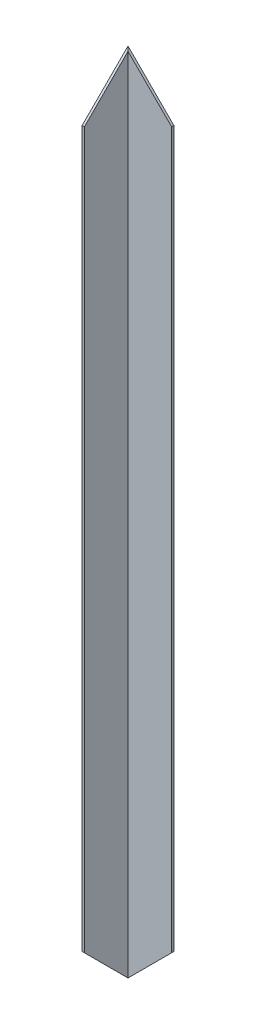
ISO-10303-21;
HEADER;
FILE_DESCRIPTION(('STEP AP214'),'2;1');
FILE_NAME('part.step','',(''),(''),'','','');
FILE_SCHEMA(('AUTOMOTIVE_DESIGN { 1 0 10303 214 1 1 1 1 }'));
ENDSEC;
DATA;
#1=APPLICATION_CONTEXT('core data for automotive mechanical design processes');
#2=APPLICATION_PROTOCOL_DEFINITION('international standard','automotive_design',2000,#1);
#3=PRODUCT_CONTEXT('',#1,'mechanical');
#4=PRODUCT('Part','Part','',(#3));
#5=PRODUCT_RELATED_PRODUCT_CATEGORY('part','',(#4));
#6=PRODUCT_DEFINITION_FORMATION('','',#4);
#7=PRODUCT_DEFINITION_CONTEXT('part definition',#1,'design');
#8=PRODUCT_DEFINITION('design','',#6,#7);
#9=PRODUCT_DEFINITION_SHAPE('','',#8);
#10=(LENGTH_UNIT() NAMED_UNIT(*) SI_UNIT(.MILLI.,.METRE.));
#11=(NAMED_UNIT(*) PLANE_ANGLE_UNIT() SI_UNIT($,.RADIAN.));
#12=(NAMED_UNIT(*) SI_UNIT($,.STERADIAN.) SOLID_ANGLE_UNIT());
#13=UNCERTAINTY_MEASURE_WITH_UNIT(LENGTH_MEASURE(1.E-05),#10,'distance_accuracy_value','');
#14=(GEOMETRIC_REPRESENTATION_CONTEXT(3) GLOBAL_UNCERTAINTY_ASSIGNED_CONTEXT((#13)) GLOBAL_UNIT_ASSIGNED_CONTEXT((#10,
#11,#12)) REPRESENTATION_CONTEXT('',''));
#15=CARTESIAN_POINT('',(0.,0.,0.));
#16=DIRECTION('',(0.,0.,1.));
#17=DIRECTION('',(1.,0.,0.));
#18=AXIS2_PLACEMENT_3D('',#15,#16,#17);
#19=CARTESIAN_POINT('',(-20.,704.,-20.1136363636364));
#20=DIRECTION('',(1.,0.,0.));
#21=DIRECTION('',(0.,0.,-1.));
#22=AXIS2_PLACEMENT_3D('',#19,#20,#21);
#23=PLANE('',#22);
#24=DIRECTION('',(0.,-1.,0.));
#25=VECTOR('',#24,1.);
#26=CARTESIAN_POINT('',(-20.,704.,19.8863636363636));
#27=LINE('',#26,#25);
#28=CARTESIAN_POINT('',(-20.,664.,19.8863636363636));
#29=VERTEX_POINT('',#28);
#30=CARTESIAN_POINT('',(-20.,39.9999999999996,19.8863636363636));
#31=VERTEX_POINT('',#30);
#32=EDGE_CURVE('E109',#29,#31,#27,.T.);
#33=ORIENTED_EDGE('',*,*,#32,.F.);
#34=DIRECTION('',(0.,-0.707106781186544,0.707106781186551));
#35=VECTOR('',#34,1.);
#36=CARTESIAN_POINT('',(-20.,704.,-20.1136363636364));
#37=LINE('',#36,#35);
#38=CARTESIAN_POINT('',(-20.,704.,-20.1136363636364));
#39=VERTEX_POINT('',#38);
#40=EDGE_CURVE('E127',#39,#29,#37,.T.);
#41=ORIENTED_EDGE('',*,*,#40,.F.);
#42=DIRECTION('',(0.,-1.,0.));
#43=VECTOR('',#42,1.);
#44=CARTESIAN_POINT('',(-20.,704.,-20.1136363636364));
#45=LINE('',#44,#43);
#46=CARTESIAN_POINT('',(-20.,0.,-20.1136363636364));
#47=VERTEX_POINT('',#46);
#48=EDGE_CURVE('E95',#39,#47,#45,.T.);
#49=ORIENTED_EDGE('',*,*,#48,.T.);
#50=DIRECTION('',(0.,-0.707106781186544,-0.707106781186551));
#51=VECTOR('',#50,1.);
#52=CARTESIAN_POINT('',(-20.,0.,-20.1136363636364));
#53=LINE('',#52,#51);
#54=EDGE_CURVE('E126',#31,#47,#53,.T.);
#55=ORIENTED_EDGE('',*,*,#54,.F.);
#56=EDGE_LOOP('',(#33,#41,#49,#55));
#57=FACE_BOUND('',#56,.T.);
#58=ADVANCED_FACE('F32',(#57),#23,.F.);
#59=CARTESIAN_POINT('',(-20.,704.,19.8863636363636));
#60=DIRECTION('',(0.,0.,-1.));
#61=DIRECTION('',(-1.,0.,0.));
#62=AXIS2_PLACEMENT_3D('',#59,#60,#61);
#63=PLANE('',#62);
#64=DIRECTION('',(0.,-1.,0.));
#65=VECTOR('',#64,1.);
#66=CARTESIAN_POINT('',(-18.,704.,19.8863636363636));
#67=LINE('',#66,#65);
#68=CARTESIAN_POINT('',(-18.,664.,19.8863636363636));
#69=VERTEX_POINT('',#68);
#70=CARTESIAN_POINT('',(-18.,39.9999999999996,19.8863636363636));
#71=VERTEX_POINT('',#70);
#72=EDGE_CURVE('E107',#69,#71,#67,.T.);
#73=ORIENTED_EDGE('',*,*,#72,.F.);
#74=DIRECTION('',(-1.,0.,0.));
#75=VECTOR('',#74,1.);
#76=CARTESIAN_POINT('',(20.,664.,19.8863636363636));
#77=LINE('',#76,#75);
#78=EDGE_CURVE('E130',#69,#29,#77,.T.);
#79=ORIENTED_EDGE('',*,*,#78,.T.);
#80=ORIENTED_EDGE('',*,*,#32,.T.);
#81=DIRECTION('',(-1.,0.,0.));
#82=VECTOR('',#81,1.);
#83=CARTESIAN_POINT('',(570.,39.9999999999996,19.8863636363635));
#84=LINE('',#83,#82);
#85=EDGE_CURVE('E139',#71,#31,#84,.T.);
#86=ORIENTED_EDGE('',*,*,#85,.F.);
#87=EDGE_LOOP('',(#73,#79,#80,#86));
#88=FACE_BOUND('',#87,.T.);
#89=ADVANCED_FACE('F153',(#88),#63,.F.);
#90=CARTESIAN_POINT('',(-18.,704.,-18.1136363636364));
#91=DIRECTION('',(-1.,0.,0.));
#92=DIRECTION('',(0.,0.,1.));
#93=AXIS2_PLACEMENT_3D('',#90,#91,#92);
#94=PLANE('',#93);
#95=DIRECTION('',(0.,-1.,0.));
#96=VECTOR('',#95,1.);
#97=CARTESIAN_POINT('',(-18.,704.,-18.1136363636364));
#98=LINE('',#97,#96);
#99=CARTESIAN_POINT('',(-18.,702.,-18.1136363636364));
#100=VERTEX_POINT('',#99);
#101=CARTESIAN_POINT('',(-18.,2.,-18.1136363636364));
#102=VERTEX_POINT('',#101);
#103=EDGE_CURVE('E100',#100,#102,#98,.T.);
#104=ORIENTED_EDGE('',*,*,#103,.F.);
#105=DIRECTION('',(0.,-0.707106781186544,0.707106781186551));
#106=VECTOR('',#105,1.);
#107=CARTESIAN_POINT('',(-18.,703.,-19.1136363636363));
#108=LINE('',#107,#106);
#109=EDGE_CURVE('E132',#100,#69,#108,.T.);
#110=ORIENTED_EDGE('',*,*,#109,.T.);
#111=ORIENTED_EDGE('',*,*,#72,.T.);
#112=DIRECTION('',(0.,-0.707106781186544,-0.707106781186551));
#113=VECTOR('',#112,1.);
#114=CARTESIAN_POINT('',(-18.,352.999999999996,332.886363636364));
#115=LINE('',#114,#113);
#116=EDGE_CURVE('E120',#71,#102,#115,.T.);
#117=ORIENTED_EDGE('',*,*,#116,.T.);
#118=EDGE_LOOP('',(#104,#110,#111,#117));
#119=FACE_BOUND('',#118,.T.);
#120=ADVANCED_FACE('F148',(#119),#94,.F.);
#121=CARTESIAN_POINT('',(-18.,704.,-18.1136363636364));
#122=DIRECTION('',(0.,0.,-1.));
#123=DIRECTION('',(-1.,0.,0.));
#124=AXIS2_PLACEMENT_3D('',#121,#122,#123);
#125=PLANE('',#124);
#126=DIRECTION('',(0.,-1.,0.));
#127=VECTOR('',#126,1.);
#128=CARTESIAN_POINT('',(20.,704.,-18.1136363636364));
#129=LINE('',#128,#127);
#130=CARTESIAN_POINT('',(20.,664.,-18.1136363636364));
#131=VERTEX_POINT('',#130);
#132=CARTESIAN_POINT('',(20.,40.0000000000001,-18.1136363636364));
#133=VERTEX_POINT('',#132);
#134=EDGE_CURVE('E46',#131,#133,#129,.T.);
#135=ORIENTED_EDGE('',*,*,#134,.F.);
#136=DIRECTION('',(-0.707106781186551,0.707106781186544,0.));
#137=VECTOR('',#136,1.);
#138=CARTESIAN_POINT('',(-19.,703.,-18.1136363636364));
#139=LINE('',#138,#137);
#140=EDGE_CURVE('E90',#131,#100,#139,.T.);
#141=ORIENTED_EDGE('',*,*,#140,.T.);
#142=ORIENTED_EDGE('',*,*,#103,.T.);
#143=DIRECTION('',(0.707106781186547,0.707106781186549,0.));
#144=VECTOR('',#143,1.);
#145=CARTESIAN_POINT('',(333.,353.000000000001,-18.1136363636364));
#146=LINE('',#145,#144);
#147=EDGE_CURVE('E102',#102,#133,#146,.T.);
#148=ORIENTED_EDGE('',*,*,#147,.T.);
#149=EDGE_LOOP('',(#135,#141,#142,#148));
#150=FACE_BOUND('',#149,.T.);
#151=ADVANCED_FACE('F144',(#150),#125,.F.);
#152=CARTESIAN_POINT('',(20.,704.,-20.1136363636364));
#153=DIRECTION('',(-1.,0.,0.));
#154=DIRECTION('',(0.,0.,1.));
#155=AXIS2_PLACEMENT_3D('',#152,#153,#154);
#156=PLANE('',#155);
#157=DIRECTION('',(0.,-1.,0.));
#158=VECTOR('',#157,1.);
#159=CARTESIAN_POINT('',(20.,704.,-20.1136363636364));
#160=LINE('',#159,#158);
#161=CARTESIAN_POINT('',(20.,664.,-20.1136363636364));
#162=VERTEX_POINT('',#161);
#163=CARTESIAN_POINT('',(20.,40.0000000000001,-20.1136363636364));
#164=VERTEX_POINT('',#163);
#165=EDGE_CURVE('E54',#162,#164,#160,.T.);
#166=ORIENTED_EDGE('',*,*,#165,.F.);
#167=DIRECTION('',(0.,0.,-1.));
#168=VECTOR('',#167,1.);
#169=CARTESIAN_POINT('',(20.,664.,19.8863636363636));
#170=LINE('',#169,#168);
#171=EDGE_CURVE('E86',#131,#162,#170,.T.);
#172=ORIENTED_EDGE('',*,*,#171,.F.);
#173=ORIENTED_EDGE('',*,*,#134,.T.);
#174=DIRECTION('',(0.,0.,-1.));
#175=VECTOR('',#174,1.);
#176=CARTESIAN_POINT('',(20.,40.0000000000001,569.886363636364));
#177=LINE('',#176,#175);
#178=EDGE_CURVE('E98',#133,#164,#177,.T.);
#179=ORIENTED_EDGE('',*,*,#178,.T.);
#180=EDGE_LOOP('',(#166,#172,#173,#179));
#181=FACE_BOUND('',#180,.T.);
#182=ADVANCED_FACE('F97',(#181),#156,.F.);
#183=CARTESIAN_POINT('',(-20.,704.,-20.1136363636364));
#184=DIRECTION('',(0.,0.,1.));
#185=DIRECTION('',(1.,0.,0.));
#186=AXIS2_PLACEMENT_3D('',#183,#184,#185);
#187=PLANE('',#186);
#188=ORIENTED_EDGE('',*,*,#48,.F.);
#189=DIRECTION('',(-0.707106781186551,0.707106781186544,0.));
#190=VECTOR('',#189,1.);
#191=CARTESIAN_POINT('',(-20.,704.,-20.1136363636364));
#192=LINE('',#191,#190);
#193=EDGE_CURVE('E88',#162,#39,#192,.T.);
#194=ORIENTED_EDGE('',*,*,#193,.F.);
#195=ORIENTED_EDGE('',*,*,#165,.T.);
#196=DIRECTION('',(0.707106781186546,0.707106781186548,0.));
#197=VECTOR('',#196,1.);
#198=CARTESIAN_POINT('',(-20.,0.,-20.1136363636364));
#199=LINE('',#198,#197);
#200=EDGE_CURVE('E115',#47,#164,#199,.T.);
#201=ORIENTED_EDGE('',*,*,#200,.F.);
#202=EDGE_LOOP('',(#188,#194,#195,#201));
#203=FACE_BOUND('',#202,.T.);
#204=ADVANCED_FACE('F93',(#203),#187,.F.);
#205=CARTESIAN_POINT('',(-20.,0.,569.886363636364));
#206=DIRECTION('',(-0.707106781186549,0.707106781186547,0.));
#207=DIRECTION('',(-0.707106781186547,-0.707106781186549,0.));
#208=AXIS2_PLACEMENT_3D('',#205,#206,#207);
#209=PLANE('',#208);
#210=ORIENTED_EDGE('',*,*,#147,.F.);
#211=DIRECTION('',(-0.577350269189623,-0.577350269189624,-0.57735026918963));
#212=VECTOR('',#211,1.);
#213=CARTESIAN_POINT('',(176.666666666667,196.666666666668,176.553030303033));
#214=LINE('',#213,#212);
#215=EDGE_CURVE('E39',#102,#47,#214,.T.);
#216=ORIENTED_EDGE('',*,*,#215,.T.);
#217=ORIENTED_EDGE('',*,*,#200,.T.);
#218=ORIENTED_EDGE('',*,*,#178,.F.);
#219=EDGE_LOOP('',(#210,#216,#217,#218));
#220=FACE_BOUND('',#219,.T.);
#221=ADVANCED_FACE('F114',(#220),#209,.F.);
#222=CARTESIAN_POINT('',(570.,0.,-20.1136363636365));
#223=DIRECTION('',(0.,0.707106781186551,-0.707106781186544));
#224=DIRECTION('',(0.,0.707106781186544,0.707106781186551));
#225=AXIS2_PLACEMENT_3D('',#222,#223,#224);
#226=PLANE('',#225);
#227=ORIENTED_EDGE('',*,*,#85,.T.);
#228=ORIENTED_EDGE('',*,*,#54,.T.);
#229=ORIENTED_EDGE('',*,*,#215,.F.);
#230=ORIENTED_EDGE('',*,*,#116,.F.);
#231=EDGE_LOOP('',(#227,#228,#229,#230));
#232=FACE_BOUND('',#231,.T.);
#233=ADVANCED_FACE('F151',(#232),#226,.F.);
#234=CARTESIAN_POINT('',(20.,704.,-20.1136363636364));
#235=DIRECTION('',(0.,-0.707106781186551,-0.707106781186544));
#236=DIRECTION('',(0.,0.707106781186544,-0.707106781186551));
#237=AXIS2_PLACEMENT_3D('',#234,#235,#236);
#238=PLANE('',#237);
#239=ORIENTED_EDGE('',*,*,#109,.F.);
#240=DIRECTION('',(-0.577350269189628,0.577350269189622,-0.577350269189628));
#241=VECTOR('',#240,1.);
#242=CARTESIAN_POINT('',(-6.66666666666658,690.666666666667,-6.78030303030294));
#243=LINE('',#242,#241);
#244=EDGE_CURVE('E11',#100,#39,#243,.T.);
#245=ORIENTED_EDGE('',*,*,#244,.T.);
#246=ORIENTED_EDGE('',*,*,#40,.T.);
#247=ORIENTED_EDGE('',*,*,#78,.F.);
#248=EDGE_LOOP('',(#239,#245,#246,#247));
#249=FACE_BOUND('',#248,.T.);
#250=ADVANCED_FACE('F154',(#249),#238,.F.);
#251=CARTESIAN_POINT('',(-20.,704.,19.8863636363636));
#252=DIRECTION('',(-0.707106781186544,-0.707106781186551,0.));
#253=DIRECTION('',(0.707106781186551,-0.707106781186544,0.));
#254=AXIS2_PLACEMENT_3D('',#251,#252,#253);
#255=PLANE('',#254);
#256=ORIENTED_EDGE('',*,*,#171,.T.);
#257=ORIENTED_EDGE('',*,*,#193,.T.);
#258=ORIENTED_EDGE('',*,*,#244,.F.);
#259=ORIENTED_EDGE('',*,*,#140,.F.);
#260=EDGE_LOOP('',(#256,#257,#258,#259));
#261=FACE_BOUND('',#260,.T.);
#262=ADVANCED_FACE('F87',(#261),#255,.F.);
#263=CLOSED_SHELL('',(#58,#89,#120,#151,#182,#204,#221,#233,#250,#262));
#264=MANIFOLD_SOLID_BREP('B2',#263);
#265=ADVANCED_BREP_SHAPE_REPRESENTATION('',(#18,#264),#14);
#266=SHAPE_DEFINITION_REPRESENTATION(#9,#265);
ENDSEC;
END-ISO-10303-21;
